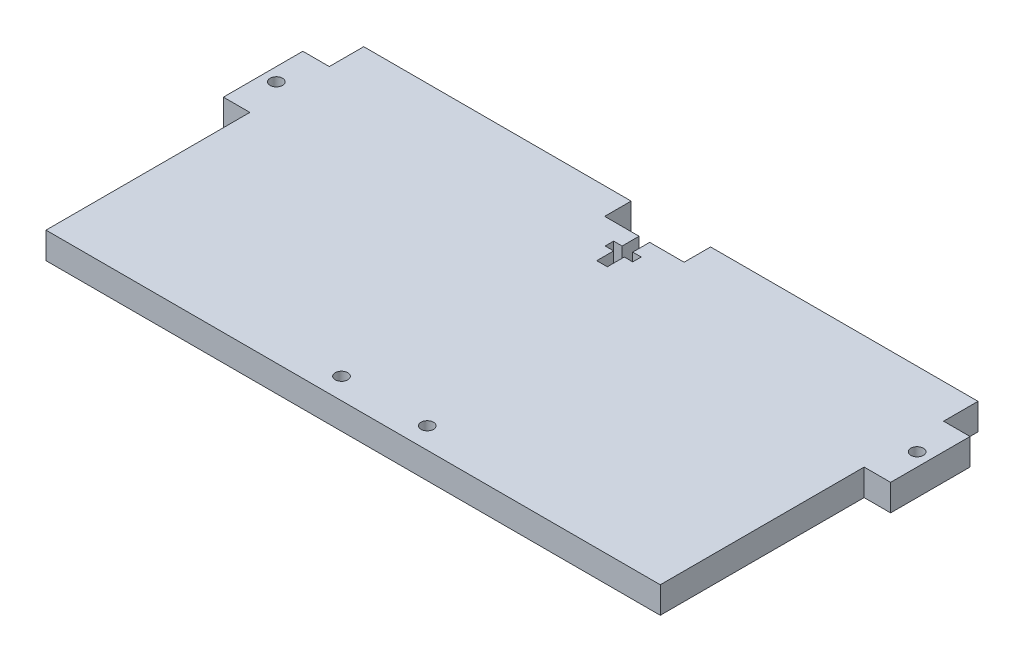
ISO-10303-21;
HEADER;
FILE_DESCRIPTION(('STEP AP214'),'2;1');
FILE_NAME('part.step','',(''),(''),'','','');
FILE_SCHEMA(('AUTOMOTIVE_DESIGN { 1 0 10303 214 1 1 1 1 }'));
ENDSEC;
DATA;
#1=APPLICATION_CONTEXT('core data for automotive mechanical design processes');
#2=APPLICATION_PROTOCOL_DEFINITION('international standard','automotive_design',2000,#1);
#3=PRODUCT_CONTEXT('',#1,'mechanical');
#4=PRODUCT('Part','Part','',(#3));
#5=PRODUCT_RELATED_PRODUCT_CATEGORY('part','',(#4));
#6=PRODUCT_DEFINITION_FORMATION('','',#4);
#7=PRODUCT_DEFINITION_CONTEXT('part definition',#1,'design');
#8=PRODUCT_DEFINITION('design','',#6,#7);
#9=PRODUCT_DEFINITION_SHAPE('','',#8);
#10=(LENGTH_UNIT() NAMED_UNIT(*) SI_UNIT(.MILLI.,.METRE.));
#11=(NAMED_UNIT(*) PLANE_ANGLE_UNIT() SI_UNIT($,.RADIAN.));
#12=(NAMED_UNIT(*) SI_UNIT($,.STERADIAN.) SOLID_ANGLE_UNIT());
#13=UNCERTAINTY_MEASURE_WITH_UNIT(LENGTH_MEASURE(1.E-05),#10,'distance_accuracy_value','');
#14=(GEOMETRIC_REPRESENTATION_CONTEXT(3) GLOBAL_UNCERTAINTY_ASSIGNED_CONTEXT((#13)) GLOBAL_UNIT_ASSIGNED_CONTEXT((#10,
#11,#12)) REPRESENTATION_CONTEXT('',''));
#15=CARTESIAN_POINT('',(0.,0.,0.));
#16=DIRECTION('',(0.,0.,1.));
#17=DIRECTION('',(1.,0.,0.));
#18=AXIS2_PLACEMENT_3D('',#15,#16,#17);
#19=CARTESIAN_POINT('',(-9.52499999999999,6.35,-34.925));
#20=DIRECTION('',(0.,0.,1.));
#21=DIRECTION('',(1.,0.,0.));
#22=AXIS2_PLACEMENT_3D('',#19,#20,#21);
#23=PLANE('',#22);
#24=DIRECTION('',(-1.,0.,0.));
#25=VECTOR('',#24,1.);
#26=CARTESIAN_POINT('',(-9.52499999999999,6.35,-34.925));
#27=LINE('',#26,#25);
#28=CARTESIAN_POINT('',(-1.27,6.35,-34.925));
#29=VERTEX_POINT('',#28);
#30=CARTESIAN_POINT('',(-9.52499999999999,6.35,-34.925));
#31=VERTEX_POINT('',#30);
#32=EDGE_CURVE('E454',#29,#31,#27,.T.);
#33=ORIENTED_EDGE('',*,*,#32,.F.);
#34=DIRECTION('',(0.,1.,0.));
#35=VECTOR('',#34,1.);
#36=CARTESIAN_POINT('',(-1.27,0.,-34.925));
#37=LINE('',#36,#35);
#38=CARTESIAN_POINT('',(-1.27,0.,-34.925));
#39=VERTEX_POINT('',#38);
#40=EDGE_CURVE('E328',#39,#29,#37,.T.);
#41=ORIENTED_EDGE('',*,*,#40,.F.);
#42=DIRECTION('',(-1.,0.,0.));
#43=VECTOR('',#42,1.);
#44=CARTESIAN_POINT('',(-9.52499999999999,0.,-34.925));
#45=LINE('',#44,#43);
#46=CARTESIAN_POINT('',(-9.52499999999999,0.,-34.925));
#47=VERTEX_POINT('',#46);
#48=EDGE_CURVE('E200',#39,#47,#45,.T.);
#49=ORIENTED_EDGE('',*,*,#48,.T.);
#50=DIRECTION('',(0.,-1.,0.));
#51=VECTOR('',#50,1.);
#52=CARTESIAN_POINT('',(-9.52499999999999,6.35,-34.925));
#53=LINE('',#52,#51);
#54=EDGE_CURVE('E256',#31,#47,#53,.T.);
#55=ORIENTED_EDGE('',*,*,#54,.F.);
#56=EDGE_LOOP('',(#33,#41,#49,#55));
#57=FACE_BOUND('',#56,.T.);
#58=ADVANCED_FACE('F32',(#57),#23,.F.);
#59=CARTESIAN_POINT('',(0.,6.35,0.));
#60=DIRECTION('',(0.,-1.,0.));
#61=DIRECTION('',(0.,0.,-1.));
#62=AXIS2_PLACEMENT_3D('',#59,#60,#61);
#63=PLANE('',#62);
#64=CARTESIAN_POINT('',(-7.87399999999999,6.35,29.845));
#65=DIRECTION('',(0.,1.,0.));
#66=DIRECTION('',(0.,0.,1.));
#67=AXIS2_PLACEMENT_3D('',#64,#65,#66);
#68=CIRCLE('',#67,1.5);
#69=CARTESIAN_POINT('',(-7.87399999999999,6.35,31.345));
#70=VERTEX_POINT('',#69);
#71=EDGE_CURVE('E429',#70,#70,#68,.T.);
#72=ORIENTED_EDGE('',*,*,#71,.F.);
#73=EDGE_LOOP('',(#72));
#74=FACE_BOUND('',#73,.T.);
#75=CARTESIAN_POINT('',(12.7,6.35,29.845));
#76=DIRECTION('',(0.,1.,0.));
#77=DIRECTION('',(0.,0.,1.));
#78=AXIS2_PLACEMENT_3D('',#75,#76,#77);
#79=CIRCLE('',#78,1.5);
#80=CARTESIAN_POINT('',(12.7,6.35,31.345));
#81=VERTEX_POINT('',#80);
#82=EDGE_CURVE('E432',#81,#81,#79,.T.);
#83=ORIENTED_EDGE('',*,*,#82,.F.);
#84=EDGE_LOOP('',(#83));
#85=FACE_BOUND('',#84,.T.);
#86=CARTESIAN_POINT('',(-76.835,6.35,-23.495));
#87=DIRECTION('',(0.,1.,0.));
#88=DIRECTION('',(0.,0.,1.));
#89=AXIS2_PLACEMENT_3D('',#86,#87,#88);
#90=CIRCLE('',#89,1.5);
#91=CARTESIAN_POINT('',(-76.835,6.35,-21.995));
#92=VERTEX_POINT('',#91);
#93=EDGE_CURVE('E198',#92,#92,#90,.T.);
#94=ORIENTED_EDGE('',*,*,#93,.F.);
#95=EDGE_LOOP('',(#94));
#96=FACE_BOUND('',#95,.T.);
#97=DIRECTION('',(-1.,0.,0.));
#98=VECTOR('',#97,1.);
#99=CARTESIAN_POINT('',(-1.27,6.35,-30.861));
#100=LINE('',#99,#98);
#101=CARTESIAN_POINT('',(-1.27,6.35,-30.861));
#102=VERTEX_POINT('',#101);
#103=CARTESIAN_POINT('',(-3.30199999999999,6.35,-30.861));
#104=VERTEX_POINT('',#103);
#105=EDGE_CURVE('E385',#102,#104,#100,.T.);
#106=ORIENTED_EDGE('',*,*,#105,.F.);
#107=DIRECTION('',(0.,0.,1.));
#108=VECTOR('',#107,1.);
#109=CARTESIAN_POINT('',(-1.27,6.35,-34.925));
#110=LINE('',#109,#108);
#111=EDGE_CURVE('E383',#29,#102,#110,.T.);
#112=ORIENTED_EDGE('',*,*,#111,.F.);
#113=ORIENTED_EDGE('',*,*,#32,.T.);
#114=DIRECTION('',(0.,0.,-1.));
#115=VECTOR('',#114,1.);
#116=CARTESIAN_POINT('',(-9.52499999999999,6.35,-34.925));
#117=LINE('',#116,#115);
#118=CARTESIAN_POINT('',(-9.52499999999999,6.35,-41.275));
#119=VERTEX_POINT('',#118);
#120=EDGE_CURVE('E457',#31,#119,#117,.T.);
#121=ORIENTED_EDGE('',*,*,#120,.T.);
#122=DIRECTION('',(-1.,0.,0.));
#123=VECTOR('',#122,1.);
#124=CARTESIAN_POINT('',(-9.52499999999999,6.35,-41.275));
#125=LINE('',#124,#123);
#126=CARTESIAN_POINT('',(-73.66,6.35,-41.275));
#127=VERTEX_POINT('',#126);
#128=EDGE_CURVE('E459',#119,#127,#125,.T.);
#129=ORIENTED_EDGE('',*,*,#128,.T.);
#130=DIRECTION('',(0.,0.,1.));
#131=VECTOR('',#130,1.);
#132=CARTESIAN_POINT('',(-73.66,6.35,-34.925));
#133=LINE('',#132,#131);
#134=CARTESIAN_POINT('',(-73.66,6.35,-33.02));
#135=VERTEX_POINT('',#134);
#136=EDGE_CURVE('E461',#127,#135,#133,.T.);
#137=ORIENTED_EDGE('',*,*,#136,.T.);
#138=DIRECTION('',(-1.,0.,0.));
#139=VECTOR('',#138,1.);
#140=CARTESIAN_POINT('',(-80.01,6.35,-33.02));
#141=LINE('',#140,#139);
#142=CARTESIAN_POINT('',(-80.01,6.35,-33.02));
#143=VERTEX_POINT('',#142);
#144=EDGE_CURVE('E463',#135,#143,#141,.T.);
#145=ORIENTED_EDGE('',*,*,#144,.T.);
#146=DIRECTION('',(0.,0.,1.));
#147=VECTOR('',#146,1.);
#148=CARTESIAN_POINT('',(-80.01,6.35,-13.97));
#149=LINE('',#148,#147);
#150=CARTESIAN_POINT('',(-80.01,6.35,-13.97));
#151=VERTEX_POINT('',#150);
#152=EDGE_CURVE('E465',#143,#151,#149,.T.);
#153=ORIENTED_EDGE('',*,*,#152,.T.);
#154=DIRECTION('',(1.,0.,0.));
#155=VECTOR('',#154,1.);
#156=CARTESIAN_POINT('',(-80.01,6.35,-13.97));
#157=LINE('',#156,#155);
#158=CARTESIAN_POINT('',(-73.66,6.35,-13.97));
#159=VERTEX_POINT('',#158);
#160=EDGE_CURVE('E467',#151,#159,#157,.T.);
#161=ORIENTED_EDGE('',*,*,#160,.T.);
#162=DIRECTION('',(0.,0.,1.));
#163=VECTOR('',#162,1.);
#164=CARTESIAN_POINT('',(-73.66,6.35,34.925));
#165=LINE('',#164,#163);
#166=CARTESIAN_POINT('',(-73.66,6.35,34.925));
#167=VERTEX_POINT('',#166);
#168=EDGE_CURVE('E469',#159,#167,#165,.T.);
#169=ORIENTED_EDGE('',*,*,#168,.T.);
#170=DIRECTION('',(1.,0.,0.));
#171=VECTOR('',#170,1.);
#172=CARTESIAN_POINT('',(-73.66,6.35,34.925));
#173=LINE('',#172,#171);
#174=CARTESIAN_POINT('',(73.66,6.35,34.925));
#175=VERTEX_POINT('',#174);
#176=EDGE_CURVE('E471',#167,#175,#173,.T.);
#177=ORIENTED_EDGE('',*,*,#176,.T.);
#178=DIRECTION('',(0.,0.,-1.));
#179=VECTOR('',#178,1.);
#180=CARTESIAN_POINT('',(73.66,6.35,34.925));
#181=LINE('',#180,#179);
#182=CARTESIAN_POINT('',(73.66,6.35,-13.97));
#183=VERTEX_POINT('',#182);
#184=EDGE_CURVE('E172',#175,#183,#181,.T.);
#185=ORIENTED_EDGE('',*,*,#184,.T.);
#186=DIRECTION('',(1.,0.,0.));
#187=VECTOR('',#186,1.);
#188=CARTESIAN_POINT('',(80.01,6.35,-13.97));
#189=LINE('',#188,#187);
#190=CARTESIAN_POINT('',(80.01,6.35,-13.97));
#191=VERTEX_POINT('',#190);
#192=EDGE_CURVE('E163',#183,#191,#189,.T.);
#193=ORIENTED_EDGE('',*,*,#192,.T.);
#194=DIRECTION('',(0.,0.,-1.));
#195=VECTOR('',#194,1.);
#196=CARTESIAN_POINT('',(80.01,6.35,-13.97));
#197=LINE('',#196,#195);
#198=CARTESIAN_POINT('',(80.01,6.35,-33.02));
#199=VERTEX_POINT('',#198);
#200=EDGE_CURVE('E169',#191,#199,#197,.T.);
#201=ORIENTED_EDGE('',*,*,#200,.T.);
#202=DIRECTION('',(-1.,0.,0.));
#203=VECTOR('',#202,1.);
#204=CARTESIAN_POINT('',(80.01,6.35,-33.02));
#205=LINE('',#204,#203);
#206=CARTESIAN_POINT('',(73.66,6.35,-33.02));
#207=VERTEX_POINT('',#206);
#208=EDGE_CURVE('E189',#199,#207,#205,.T.);
#209=ORIENTED_EDGE('',*,*,#208,.T.);
#210=DIRECTION('',(0.,0.,-1.));
#211=VECTOR('',#210,1.);
#212=CARTESIAN_POINT('',(73.66,6.35,-41.275));
#213=LINE('',#212,#211);
#214=CARTESIAN_POINT('',(73.66,6.35,-41.275));
#215=VERTEX_POINT('',#214);
#216=EDGE_CURVE('E56',#207,#215,#213,.T.);
#217=ORIENTED_EDGE('',*,*,#216,.T.);
#218=DIRECTION('',(-1.,0.,0.));
#219=VECTOR('',#218,1.);
#220=CARTESIAN_POINT('',(9.52500000000001,6.35,-41.275));
#221=LINE('',#220,#219);
#222=CARTESIAN_POINT('',(9.52500000000001,6.35,-41.275));
#223=VERTEX_POINT('',#222);
#224=EDGE_CURVE('E122',#215,#223,#221,.T.);
#225=ORIENTED_EDGE('',*,*,#224,.T.);
#226=DIRECTION('',(0.,0.,1.));
#227=VECTOR('',#226,1.);
#228=CARTESIAN_POINT('',(9.52500000000001,6.35,-41.275));
#229=LINE('',#228,#227);
#230=CARTESIAN_POINT('',(9.52500000000001,6.35,-34.925));
#231=VERTEX_POINT('',#230);
#232=EDGE_CURVE('E267',#223,#231,#229,.T.);
#233=ORIENTED_EDGE('',*,*,#232,.T.);
#234=CARTESIAN_POINT('',(1.27,6.35,-34.925));
#235=VERTEX_POINT('',#234);
#236=EDGE_CURVE('E455',#231,#235,#27,.T.);
#237=ORIENTED_EDGE('',*,*,#236,.T.);
#238=DIRECTION('',(0.,0.,-1.));
#239=VECTOR('',#238,1.);
#240=CARTESIAN_POINT('',(1.27,6.35,-34.925));
#241=LINE('',#240,#239);
#242=CARTESIAN_POINT('',(1.27,6.35,-30.861));
#243=VERTEX_POINT('',#242);
#244=EDGE_CURVE('E47',#243,#235,#241,.T.);
#245=ORIENTED_EDGE('',*,*,#244,.F.);
#246=DIRECTION('',(-1.,0.,0.));
#247=VECTOR('',#246,1.);
#248=CARTESIAN_POINT('',(1.27,6.35,-30.861));
#249=LINE('',#248,#247);
#250=CARTESIAN_POINT('',(3.30199999999999,6.35,-30.861));
#251=VERTEX_POINT('',#250);
#252=EDGE_CURVE('E407',#251,#243,#249,.T.);
#253=ORIENTED_EDGE('',*,*,#252,.F.);
#254=DIRECTION('',(0.,0.,-1.));
#255=VECTOR('',#254,1.);
#256=CARTESIAN_POINT('',(3.30199999999999,6.35,-30.861));
#257=LINE('',#256,#255);
#258=CARTESIAN_POINT('',(3.30199999999999,6.35,-28.829));
#259=VERTEX_POINT('',#258);
#260=EDGE_CURVE('E366',#259,#251,#257,.T.);
#261=ORIENTED_EDGE('',*,*,#260,.F.);
#262=DIRECTION('',(1.,0.,0.));
#263=VECTOR('',#262,1.);
#264=CARTESIAN_POINT('',(1.27,6.35,-28.829));
#265=LINE('',#264,#263);
#266=CARTESIAN_POINT('',(1.27,6.35,-28.829));
#267=VERTEX_POINT('',#266);
#268=EDGE_CURVE('E403',#267,#259,#265,.T.);
#269=ORIENTED_EDGE('',*,*,#268,.F.);
#270=DIRECTION('',(0.,0.,-1.));
#271=VECTOR('',#270,1.);
#272=CARTESIAN_POINT('',(1.27,6.35,-28.829));
#273=LINE('',#272,#271);
#274=CARTESIAN_POINT('',(1.27,6.35,-24.765));
#275=VERTEX_POINT('',#274);
#276=EDGE_CURVE('E400',#275,#267,#273,.T.);
#277=ORIENTED_EDGE('',*,*,#276,.F.);
#278=DIRECTION('',(1.,0.,0.));
#279=VECTOR('',#278,1.);
#280=CARTESIAN_POINT('',(-1.27,6.35,-24.765));
#281=LINE('',#280,#279);
#282=CARTESIAN_POINT('',(-1.27,6.35,-24.765));
#283=VERTEX_POINT('',#282);
#284=EDGE_CURVE('E397',#283,#275,#281,.T.);
#285=ORIENTED_EDGE('',*,*,#284,.F.);
#286=DIRECTION('',(0.,0.,1.));
#287=VECTOR('',#286,1.);
#288=CARTESIAN_POINT('',(-1.27,6.35,-28.829));
#289=LINE('',#288,#287);
#290=CARTESIAN_POINT('',(-1.27,6.35,-28.829));
#291=VERTEX_POINT('',#290);
#292=EDGE_CURVE('E394',#291,#283,#289,.T.);
#293=ORIENTED_EDGE('',*,*,#292,.F.);
#294=DIRECTION('',(1.,0.,0.));
#295=VECTOR('',#294,1.);
#296=CARTESIAN_POINT('',(-1.27,6.35,-28.829));
#297=LINE('',#296,#295);
#298=CARTESIAN_POINT('',(-3.30199999999999,6.35,-28.829));
#299=VERTEX_POINT('',#298);
#300=EDGE_CURVE('E391',#299,#291,#297,.T.);
#301=ORIENTED_EDGE('',*,*,#300,.F.);
#302=DIRECTION('',(0.,0.,1.));
#303=VECTOR('',#302,1.);
#304=CARTESIAN_POINT('',(-3.30199999999999,6.35,-30.861));
#305=LINE('',#304,#303);
#306=EDGE_CURVE('E388',#104,#299,#305,.T.);
#307=ORIENTED_EDGE('',*,*,#306,.F.);
#308=EDGE_LOOP('',(#106,#112,#113,#121,#129,#137,#145,#153,#161,#169,#177,#185,#193,#201,#209,
#217,#225,#233,#237,#245,#253,#261,#269,#277,#285,#293,#301,#307));
#309=FACE_BOUND('',#308,.T.);
#310=CARTESIAN_POINT('',(76.835,6.35,-23.495));
#311=DIRECTION('',(0.,1.,0.));
#312=DIRECTION('',(0.,0.,-1.));
#313=AXIS2_PLACEMENT_3D('',#310,#311,#312);
#314=CIRCLE('',#313,1.5);
#315=CARTESIAN_POINT('',(76.835,6.35,-24.995));
#316=VERTEX_POINT('',#315);
#317=EDGE_CURVE('E441',#316,#316,#314,.T.);
#318=ORIENTED_EDGE('',*,*,#317,.F.);
#319=EDGE_LOOP('',(#318));
#320=FACE_BOUND('',#319,.T.);
#321=ADVANCED_FACE('F166',(#74,#85,#96,#309,#320),#63,.F.);
#322=CARTESIAN_POINT('',(0.,0.,0.));
#323=DIRECTION('',(0.,-1.,0.));
#324=DIRECTION('',(0.,0.,-1.));
#325=AXIS2_PLACEMENT_3D('',#322,#323,#324);
#326=PLANE('',#325);
#327=DIRECTION('',(0.,0.,1.));
#328=VECTOR('',#327,1.);
#329=CARTESIAN_POINT('',(-1.27,0.,-34.925));
#330=LINE('',#329,#328);
#331=CARTESIAN_POINT('',(-1.27,0.,-30.861));
#332=VERTEX_POINT('',#331);
#333=EDGE_CURVE('E410',#39,#332,#330,.T.);
#334=ORIENTED_EDGE('',*,*,#333,.T.);
#335=DIRECTION('',(-1.,0.,0.));
#336=VECTOR('',#335,1.);
#337=CARTESIAN_POINT('',(-1.27,0.,-30.861));
#338=LINE('',#337,#336);
#339=CARTESIAN_POINT('',(-3.30199999999999,0.,-30.861));
#340=VERTEX_POINT('',#339);
#341=EDGE_CURVE('E839',#332,#340,#338,.T.);
#342=ORIENTED_EDGE('',*,*,#341,.T.);
#343=DIRECTION('',(0.,0.,1.));
#344=VECTOR('',#343,1.);
#345=CARTESIAN_POINT('',(-3.30199999999999,0.,-30.861));
#346=LINE('',#345,#344);
#347=CARTESIAN_POINT('',(-3.30199999999999,0.,-28.829));
#348=VERTEX_POINT('',#347);
#349=EDGE_CURVE('E817',#340,#348,#346,.T.);
#350=ORIENTED_EDGE('',*,*,#349,.T.);
#351=DIRECTION('',(1.,0.,0.));
#352=VECTOR('',#351,1.);
#353=CARTESIAN_POINT('',(-1.27,0.,-28.829));
#354=LINE('',#353,#352);
#355=CARTESIAN_POINT('',(-1.27,0.,-28.829));
#356=VERTEX_POINT('',#355);
#357=EDGE_CURVE('E814',#348,#356,#354,.T.);
#358=ORIENTED_EDGE('',*,*,#357,.T.);
#359=DIRECTION('',(0.,0.,1.));
#360=VECTOR('',#359,1.);
#361=CARTESIAN_POINT('',(-1.27,0.,-28.829));
#362=LINE('',#361,#360);
#363=CARTESIAN_POINT('',(-1.27,0.,-24.765));
#364=VERTEX_POINT('',#363);
#365=EDGE_CURVE('E845',#356,#364,#362,.T.);
#366=ORIENTED_EDGE('',*,*,#365,.T.);
#367=DIRECTION('',(1.,0.,0.));
#368=VECTOR('',#367,1.);
#369=CARTESIAN_POINT('',(-1.27,0.,-24.765));
#370=LINE('',#369,#368);
#371=CARTESIAN_POINT('',(1.27,0.,-24.765));
#372=VERTEX_POINT('',#371);
#373=EDGE_CURVE('E807',#364,#372,#370,.T.);
#374=ORIENTED_EDGE('',*,*,#373,.T.);
#375=DIRECTION('',(0.,0.,-1.));
#376=VECTOR('',#375,1.);
#377=CARTESIAN_POINT('',(1.27,0.,-28.829));
#378=LINE('',#377,#376);
#379=CARTESIAN_POINT('',(1.27,0.,-28.829));
#380=VERTEX_POINT('',#379);
#381=EDGE_CURVE('E378',#372,#380,#378,.T.);
#382=ORIENTED_EDGE('',*,*,#381,.T.);
#383=DIRECTION('',(1.,0.,0.));
#384=VECTOR('',#383,1.);
#385=CARTESIAN_POINT('',(1.27,0.,-28.829));
#386=LINE('',#385,#384);
#387=CARTESIAN_POINT('',(3.30199999999999,0.,-28.829));
#388=VERTEX_POINT('',#387);
#389=EDGE_CURVE('E376',#380,#388,#386,.T.);
#390=ORIENTED_EDGE('',*,*,#389,.T.);
#391=DIRECTION('',(0.,0.,-1.));
#392=VECTOR('',#391,1.);
#393=CARTESIAN_POINT('',(3.30199999999999,0.,-30.861));
#394=LINE('',#393,#392);
#395=CARTESIAN_POINT('',(3.30199999999999,0.,-30.861));
#396=VERTEX_POINT('',#395);
#397=EDGE_CURVE('E363',#388,#396,#394,.T.);
#398=ORIENTED_EDGE('',*,*,#397,.T.);
#399=DIRECTION('',(-1.,0.,0.));
#400=VECTOR('',#399,1.);
#401=CARTESIAN_POINT('',(1.27,0.,-30.861));
#402=LINE('',#401,#400);
#403=CARTESIAN_POINT('',(1.27,0.,-30.861));
#404=VERTEX_POINT('',#403);
#405=EDGE_CURVE('E371',#396,#404,#402,.T.);
#406=ORIENTED_EDGE('',*,*,#405,.T.);
#407=DIRECTION('',(0.,0.,-1.));
#408=VECTOR('',#407,1.);
#409=CARTESIAN_POINT('',(1.27,0.,-34.925));
#410=LINE('',#409,#408);
#411=CARTESIAN_POINT('',(1.27,0.,-34.925));
#412=VERTEX_POINT('',#411);
#413=EDGE_CURVE('E279',#404,#412,#410,.T.);
#414=ORIENTED_EDGE('',*,*,#413,.T.);
#415=CARTESIAN_POINT('',(9.52500000000001,0.,-34.925));
#416=VERTEX_POINT('',#415);
#417=EDGE_CURVE('E201',#416,#412,#45,.T.);
#418=ORIENTED_EDGE('',*,*,#417,.F.);
#419=DIRECTION('',(0.,0.,1.));
#420=VECTOR('',#419,1.);
#421=CARTESIAN_POINT('',(9.52500000000001,0.,-41.275));
#422=LINE('',#421,#420);
#423=CARTESIAN_POINT('',(9.52500000000001,0.,-41.275));
#424=VERTEX_POINT('',#423);
#425=EDGE_CURVE('E197',#424,#416,#422,.T.);
#426=ORIENTED_EDGE('',*,*,#425,.F.);
#427=DIRECTION('',(-1.,0.,0.));
#428=VECTOR('',#427,1.);
#429=CARTESIAN_POINT('',(9.52500000000001,0.,-41.275));
#430=LINE('',#429,#428);
#431=CARTESIAN_POINT('',(73.66,0.,-41.275));
#432=VERTEX_POINT('',#431);
#433=EDGE_CURVE('E195',#432,#424,#430,.T.);
#434=ORIENTED_EDGE('',*,*,#433,.F.);
#435=DIRECTION('',(0.,0.,-1.));
#436=VECTOR('',#435,1.);
#437=CARTESIAN_POINT('',(73.66,0.,-33.02));
#438=LINE('',#437,#436);
#439=CARTESIAN_POINT('',(73.66,0.,-33.02));
#440=VERTEX_POINT('',#439);
#441=EDGE_CURVE('E227',#440,#432,#438,.T.);
#442=ORIENTED_EDGE('',*,*,#441,.F.);
#443=DIRECTION('',(-1.,0.,0.));
#444=VECTOR('',#443,1.);
#445=CARTESIAN_POINT('',(80.01,0.,-33.02));
#446=LINE('',#445,#444);
#447=CARTESIAN_POINT('',(80.01,0.,-33.02));
#448=VERTEX_POINT('',#447);
#449=EDGE_CURVE('E115',#448,#440,#446,.T.);
#450=ORIENTED_EDGE('',*,*,#449,.F.);
#451=DIRECTION('',(0.,0.,-1.));
#452=VECTOR('',#451,1.);
#453=CARTESIAN_POINT('',(80.01,0.,-13.97));
#454=LINE('',#453,#452);
#455=CARTESIAN_POINT('',(80.01,0.,-13.97));
#456=VERTEX_POINT('',#455);
#457=EDGE_CURVE('E224',#456,#448,#454,.T.);
#458=ORIENTED_EDGE('',*,*,#457,.F.);
#459=DIRECTION('',(1.,0.,0.));
#460=VECTOR('',#459,1.);
#461=CARTESIAN_POINT('',(80.01,0.,-13.97));
#462=LINE('',#461,#460);
#463=CARTESIAN_POINT('',(73.66,0.,-13.97));
#464=VERTEX_POINT('',#463);
#465=EDGE_CURVE('E181',#464,#456,#462,.T.);
#466=ORIENTED_EDGE('',*,*,#465,.F.);
#467=DIRECTION('',(0.,0.,-1.));
#468=VECTOR('',#467,1.);
#469=CARTESIAN_POINT('',(73.66,0.,34.925));
#470=LINE('',#469,#468);
#471=CARTESIAN_POINT('',(73.66,0.,34.925));
#472=VERTEX_POINT('',#471);
#473=EDGE_CURVE('E221',#472,#464,#470,.T.);
#474=ORIENTED_EDGE('',*,*,#473,.F.);
#475=DIRECTION('',(1.,0.,0.));
#476=VECTOR('',#475,1.);
#477=CARTESIAN_POINT('',(-73.66,0.,34.925));
#478=LINE('',#477,#476);
#479=CARTESIAN_POINT('',(-73.66,0.,34.925));
#480=VERTEX_POINT('',#479);
#481=EDGE_CURVE('E219',#480,#472,#478,.T.);
#482=ORIENTED_EDGE('',*,*,#481,.F.);
#483=DIRECTION('',(0.,0.,1.));
#484=VECTOR('',#483,1.);
#485=CARTESIAN_POINT('',(-73.66,0.,34.925));
#486=LINE('',#485,#484);
#487=CARTESIAN_POINT('',(-73.66,0.,-13.97));
#488=VERTEX_POINT('',#487);
#489=EDGE_CURVE('E217',#488,#480,#486,.T.);
#490=ORIENTED_EDGE('',*,*,#489,.F.);
#491=DIRECTION('',(1.,0.,0.));
#492=VECTOR('',#491,1.);
#493=CARTESIAN_POINT('',(-80.01,0.,-13.97));
#494=LINE('',#493,#492);
#495=CARTESIAN_POINT('',(-80.01,0.,-13.97));
#496=VERTEX_POINT('',#495);
#497=EDGE_CURVE('E215',#496,#488,#494,.T.);
#498=ORIENTED_EDGE('',*,*,#497,.F.);
#499=DIRECTION('',(0.,0.,1.));
#500=VECTOR('',#499,1.);
#501=CARTESIAN_POINT('',(-80.01,0.,-13.97));
#502=LINE('',#501,#500);
#503=CARTESIAN_POINT('',(-80.01,0.,-33.02));
#504=VERTEX_POINT('',#503);
#505=EDGE_CURVE('E213',#504,#496,#502,.T.);
#506=ORIENTED_EDGE('',*,*,#505,.F.);
#507=DIRECTION('',(-1.,0.,0.));
#508=VECTOR('',#507,1.);
#509=CARTESIAN_POINT('',(-80.01,0.,-33.02));
#510=LINE('',#509,#508);
#511=CARTESIAN_POINT('',(-73.66,0.,-33.02));
#512=VERTEX_POINT('',#511);
#513=EDGE_CURVE('E211',#512,#504,#510,.T.);
#514=ORIENTED_EDGE('',*,*,#513,.F.);
#515=DIRECTION('',(0.,0.,1.));
#516=VECTOR('',#515,1.);
#517=CARTESIAN_POINT('',(-73.66,0.,-33.02));
#518=LINE('',#517,#516);
#519=CARTESIAN_POINT('',(-73.66,0.,-41.275));
#520=VERTEX_POINT('',#519);
#521=EDGE_CURVE('E209',#520,#512,#518,.T.);
#522=ORIENTED_EDGE('',*,*,#521,.F.);
#523=DIRECTION('',(-1.,0.,0.));
#524=VECTOR('',#523,1.);
#525=CARTESIAN_POINT('',(-9.52499999999999,0.,-41.275));
#526=LINE('',#525,#524);
#527=CARTESIAN_POINT('',(-9.52499999999999,0.,-41.275));
#528=VERTEX_POINT('',#527);
#529=EDGE_CURVE('E206',#528,#520,#526,.T.);
#530=ORIENTED_EDGE('',*,*,#529,.F.);
#531=DIRECTION('',(0.,0.,-1.));
#532=VECTOR('',#531,1.);
#533=CARTESIAN_POINT('',(-9.52499999999999,0.,-34.925));
#534=LINE('',#533,#532);
#535=EDGE_CURVE('E204',#47,#528,#534,.T.);
#536=ORIENTED_EDGE('',*,*,#535,.F.);
#537=ORIENTED_EDGE('',*,*,#48,.F.);
#538=EDGE_LOOP('',(#334,#342,#350,#358,#366,#374,#382,#390,#398,#406,#414,#418,#426,#434,#442,
#450,#458,#466,#474,#482,#490,#498,#506,#514,#522,#530,#536,#537));
#539=FACE_BOUND('',#538,.T.);
#540=CARTESIAN_POINT('',(-7.87399999999999,0.,29.845));
#541=DIRECTION('',(0.,1.,0.));
#542=DIRECTION('',(0.,0.,1.));
#543=AXIS2_PLACEMENT_3D('',#540,#541,#542);
#544=CIRCLE('',#543,1.5);
#545=CARTESIAN_POINT('',(-7.87399999999999,0.,31.345));
#546=VERTEX_POINT('',#545);
#547=EDGE_CURVE('E412',#546,#546,#544,.T.);
#548=ORIENTED_EDGE('',*,*,#547,.T.);
#549=EDGE_LOOP('',(#548));
#550=FACE_BOUND('',#549,.T.);
#551=CARTESIAN_POINT('',(12.7,0.,29.845));
#552=DIRECTION('',(0.,1.,0.));
#553=DIRECTION('',(0.,0.,1.));
#554=AXIS2_PLACEMENT_3D('',#551,#552,#553);
#555=CIRCLE('',#554,1.5);
#556=CARTESIAN_POINT('',(12.7,0.,31.345));
#557=VERTEX_POINT('',#556);
#558=EDGE_CURVE('E435',#557,#557,#555,.T.);
#559=ORIENTED_EDGE('',*,*,#558,.T.);
#560=EDGE_LOOP('',(#559));
#561=FACE_BOUND('',#560,.T.);
#562=CARTESIAN_POINT('',(-76.835,0.,-23.495));
#563=DIRECTION('',(0.,1.,0.));
#564=DIRECTION('',(0.,0.,1.));
#565=AXIS2_PLACEMENT_3D('',#562,#563,#564);
#566=CIRCLE('',#565,1.5);
#567=CARTESIAN_POINT('',(-76.835,0.,-21.995));
#568=VERTEX_POINT('',#567);
#569=EDGE_CURVE('E444',#568,#568,#566,.T.);
#570=ORIENTED_EDGE('',*,*,#569,.T.);
#571=EDGE_LOOP('',(#570));
#572=FACE_BOUND('',#571,.T.);
#573=CARTESIAN_POINT('',(76.835,0.,-23.495));
#574=DIRECTION('',(0.,1.,0.));
#575=DIRECTION('',(0.,0.,-1.));
#576=AXIS2_PLACEMENT_3D('',#573,#574,#575);
#577=CIRCLE('',#576,1.5);
#578=CARTESIAN_POINT('',(76.835,0.,-24.995));
#579=VERTEX_POINT('',#578);
#580=EDGE_CURVE('E438',#579,#579,#577,.T.);
#581=ORIENTED_EDGE('',*,*,#580,.T.);
#582=EDGE_LOOP('',(#581));
#583=FACE_BOUND('',#582,.T.);
#584=ADVANCED_FACE('F272',(#539,#550,#561,#572,#583),#326,.T.);
#585=CARTESIAN_POINT('',(9.52500000000001,6.35,-41.275));
#586=DIRECTION('',(0.,0.,1.));
#587=DIRECTION('',(1.,0.,0.));
#588=AXIS2_PLACEMENT_3D('',#585,#586,#587);
#589=PLANE('',#588);
#590=ORIENTED_EDGE('',*,*,#433,.T.);
#591=DIRECTION('',(0.,-1.,0.));
#592=VECTOR('',#591,1.);
#593=CARTESIAN_POINT('',(9.52500000000001,6.35,-41.275));
#594=LINE('',#593,#592);
#595=EDGE_CURVE('E40',#223,#424,#594,.T.);
#596=ORIENTED_EDGE('',*,*,#595,.F.);
#597=ORIENTED_EDGE('',*,*,#224,.F.);
#598=DIRECTION('',(0.,-1.,0.));
#599=VECTOR('',#598,1.);
#600=CARTESIAN_POINT('',(73.66,6.35,-41.275));
#601=LINE('',#600,#599);
#602=EDGE_CURVE('E11',#215,#432,#601,.T.);
#603=ORIENTED_EDGE('',*,*,#602,.T.);
#604=EDGE_LOOP('',(#590,#596,#597,#603));
#605=FACE_BOUND('',#604,.T.);
#606=ADVANCED_FACE('F34',(#605),#589,.F.);
#607=CARTESIAN_POINT('',(9.52500000000001,6.35,-41.275));
#608=DIRECTION('',(1.,0.,0.));
#609=DIRECTION('',(0.,0.,-1.));
#610=AXIS2_PLACEMENT_3D('',#607,#608,#609);
#611=PLANE('',#610);
#612=ORIENTED_EDGE('',*,*,#425,.T.);
#613=DIRECTION('',(0.,-1.,0.));
#614=VECTOR('',#613,1.);
#615=CARTESIAN_POINT('',(9.52500000000001,6.35,-34.925));
#616=LINE('',#615,#614);
#617=EDGE_CURVE('E259',#231,#416,#616,.T.);
#618=ORIENTED_EDGE('',*,*,#617,.F.);
#619=ORIENTED_EDGE('',*,*,#232,.F.);
#620=ORIENTED_EDGE('',*,*,#595,.T.);
#621=EDGE_LOOP('',(#612,#618,#619,#620));
#622=FACE_BOUND('',#621,.T.);
#623=ADVANCED_FACE('F265',(#622),#611,.F.);
#624=ORIENTED_EDGE('',*,*,#417,.T.);
#625=DIRECTION('',(0.,1.,0.));
#626=VECTOR('',#625,1.);
#627=CARTESIAN_POINT('',(1.27,0.,-34.925));
#628=LINE('',#627,#626);
#629=EDGE_CURVE('E283',#412,#235,#628,.T.);
#630=ORIENTED_EDGE('',*,*,#629,.T.);
#631=ORIENTED_EDGE('',*,*,#236,.F.);
#632=ORIENTED_EDGE('',*,*,#617,.T.);
#633=EDGE_LOOP('',(#624,#630,#631,#632));
#634=FACE_BOUND('',#633,.T.);
#635=ADVANCED_FACE('F281',(#634),#23,.F.);
#636=CARTESIAN_POINT('',(-9.52499999999999,6.35,-34.925));
#637=DIRECTION('',(-1.,0.,0.));
#638=DIRECTION('',(0.,0.,1.));
#639=AXIS2_PLACEMENT_3D('',#636,#637,#638);
#640=PLANE('',#639);
#641=ORIENTED_EDGE('',*,*,#535,.T.);
#642=DIRECTION('',(0.,-1.,0.));
#643=VECTOR('',#642,1.);
#644=CARTESIAN_POINT('',(-9.52499999999999,6.35,-41.275));
#645=LINE('',#644,#643);
#646=EDGE_CURVE('E253',#119,#528,#645,.T.);
#647=ORIENTED_EDGE('',*,*,#646,.F.);
#648=ORIENTED_EDGE('',*,*,#120,.F.);
#649=ORIENTED_EDGE('',*,*,#54,.T.);
#650=EDGE_LOOP('',(#641,#647,#648,#649));
#651=FACE_BOUND('',#650,.T.);
#652=ADVANCED_FACE('F501',(#651),#640,.F.);
#653=CARTESIAN_POINT('',(-9.52499999999999,6.35,-41.275));
#654=DIRECTION('',(0.,0.,1.));
#655=DIRECTION('',(1.,0.,0.));
#656=AXIS2_PLACEMENT_3D('',#653,#654,#655);
#657=PLANE('',#656);
#658=ORIENTED_EDGE('',*,*,#529,.T.);
#659=DIRECTION('',(0.,-1.,0.));
#660=VECTOR('',#659,1.);
#661=CARTESIAN_POINT('',(-73.66,6.35,-41.275));
#662=LINE('',#661,#660);
#663=EDGE_CURVE('E250',#127,#520,#662,.T.);
#664=ORIENTED_EDGE('',*,*,#663,.F.);
#665=ORIENTED_EDGE('',*,*,#128,.F.);
#666=ORIENTED_EDGE('',*,*,#646,.T.);
#667=EDGE_LOOP('',(#658,#664,#665,#666));
#668=FACE_BOUND('',#667,.T.);
#669=ADVANCED_FACE('F505',(#668),#657,.F.);
#670=CARTESIAN_POINT('',(-73.66,6.35,-33.02));
#671=DIRECTION('',(1.,0.,0.));
#672=DIRECTION('',(0.,0.,-1.));
#673=AXIS2_PLACEMENT_3D('',#670,#671,#672);
#674=PLANE('',#673);
#675=ORIENTED_EDGE('',*,*,#521,.T.);
#676=DIRECTION('',(0.,-1.,0.));
#677=VECTOR('',#676,1.);
#678=CARTESIAN_POINT('',(-73.66,6.35,-33.02));
#679=LINE('',#678,#677);
#680=EDGE_CURVE('E247',#135,#512,#679,.T.);
#681=ORIENTED_EDGE('',*,*,#680,.F.);
#682=ORIENTED_EDGE('',*,*,#136,.F.);
#683=ORIENTED_EDGE('',*,*,#663,.T.);
#684=EDGE_LOOP('',(#675,#681,#682,#683));
#685=FACE_BOUND('',#684,.T.);
#686=ADVANCED_FACE('F510',(#685),#674,.F.);
#687=CARTESIAN_POINT('',(-80.01,6.35,-33.02));
#688=DIRECTION('',(0.,0.,1.));
#689=DIRECTION('',(1.,0.,0.));
#690=AXIS2_PLACEMENT_3D('',#687,#688,#689);
#691=PLANE('',#690);
#692=ORIENTED_EDGE('',*,*,#513,.T.);
#693=DIRECTION('',(0.,-1.,0.));
#694=VECTOR('',#693,1.);
#695=CARTESIAN_POINT('',(-80.01,6.35,-33.02));
#696=LINE('',#695,#694);
#697=EDGE_CURVE('E244',#143,#504,#696,.T.);
#698=ORIENTED_EDGE('',*,*,#697,.F.);
#699=ORIENTED_EDGE('',*,*,#144,.F.);
#700=ORIENTED_EDGE('',*,*,#680,.T.);
#701=EDGE_LOOP('',(#692,#698,#699,#700));
#702=FACE_BOUND('',#701,.T.);
#703=ADVANCED_FACE('F516',(#702),#691,.F.);
#704=CARTESIAN_POINT('',(-80.01,6.35,-13.97));
#705=DIRECTION('',(1.,0.,0.));
#706=DIRECTION('',(0.,0.,-1.));
#707=AXIS2_PLACEMENT_3D('',#704,#705,#706);
#708=PLANE('',#707);
#709=ORIENTED_EDGE('',*,*,#505,.T.);
#710=DIRECTION('',(0.,-1.,0.));
#711=VECTOR('',#710,1.);
#712=CARTESIAN_POINT('',(-80.01,6.35,-13.97));
#713=LINE('',#712,#711);
#714=EDGE_CURVE('E241',#151,#496,#713,.T.);
#715=ORIENTED_EDGE('',*,*,#714,.F.);
#716=ORIENTED_EDGE('',*,*,#152,.F.);
#717=ORIENTED_EDGE('',*,*,#697,.T.);
#718=EDGE_LOOP('',(#709,#715,#716,#717));
#719=FACE_BOUND('',#718,.T.);
#720=ADVANCED_FACE('F520',(#719),#708,.F.);
#721=CARTESIAN_POINT('',(-80.01,6.35,-13.97));
#722=DIRECTION('',(0.,0.,-1.));
#723=DIRECTION('',(-1.,0.,0.));
#724=AXIS2_PLACEMENT_3D('',#721,#722,#723);
#725=PLANE('',#724);
#726=ORIENTED_EDGE('',*,*,#497,.T.);
#727=DIRECTION('',(0.,-1.,0.));
#728=VECTOR('',#727,1.);
#729=CARTESIAN_POINT('',(-73.66,6.35,-13.97));
#730=LINE('',#729,#728);
#731=EDGE_CURVE('E238',#159,#488,#730,.T.);
#732=ORIENTED_EDGE('',*,*,#731,.F.);
#733=ORIENTED_EDGE('',*,*,#160,.F.);
#734=ORIENTED_EDGE('',*,*,#714,.T.);
#735=EDGE_LOOP('',(#726,#732,#733,#734));
#736=FACE_BOUND('',#735,.T.);
#737=ADVANCED_FACE('F524',(#736),#725,.F.);
#738=CARTESIAN_POINT('',(-73.66,6.35,34.925));
#739=DIRECTION('',(1.,0.,0.));
#740=DIRECTION('',(0.,0.,-1.));
#741=AXIS2_PLACEMENT_3D('',#738,#739,#740);
#742=PLANE('',#741);
#743=ORIENTED_EDGE('',*,*,#489,.T.);
#744=DIRECTION('',(0.,-1.,0.));
#745=VECTOR('',#744,1.);
#746=CARTESIAN_POINT('',(-73.66,6.35,34.925));
#747=LINE('',#746,#745);
#748=EDGE_CURVE('E235',#167,#480,#747,.T.);
#749=ORIENTED_EDGE('',*,*,#748,.F.);
#750=ORIENTED_EDGE('',*,*,#168,.F.);
#751=ORIENTED_EDGE('',*,*,#731,.T.);
#752=EDGE_LOOP('',(#743,#749,#750,#751));
#753=FACE_BOUND('',#752,.T.);
#754=ADVANCED_FACE('F528',(#753),#742,.F.);
#755=CARTESIAN_POINT('',(-73.66,6.35,34.925));
#756=DIRECTION('',(0.,0.,-1.));
#757=DIRECTION('',(-1.,0.,0.));
#758=AXIS2_PLACEMENT_3D('',#755,#756,#757);
#759=PLANE('',#758);
#760=ORIENTED_EDGE('',*,*,#481,.T.);
#761=DIRECTION('',(0.,-1.,0.));
#762=VECTOR('',#761,1.);
#763=CARTESIAN_POINT('',(73.66,6.35,34.925));
#764=LINE('',#763,#762);
#765=EDGE_CURVE('E232',#175,#472,#764,.T.);
#766=ORIENTED_EDGE('',*,*,#765,.F.);
#767=ORIENTED_EDGE('',*,*,#176,.F.);
#768=ORIENTED_EDGE('',*,*,#748,.T.);
#769=EDGE_LOOP('',(#760,#766,#767,#768));
#770=FACE_BOUND('',#769,.T.);
#771=ADVANCED_FACE('F477',(#770),#759,.F.);
#772=CARTESIAN_POINT('',(73.66,6.35,34.925));
#773=DIRECTION('',(-1.,0.,0.));
#774=DIRECTION('',(0.,0.,1.));
#775=AXIS2_PLACEMENT_3D('',#772,#773,#774);
#776=PLANE('',#775);
#777=ORIENTED_EDGE('',*,*,#473,.T.);
#778=DIRECTION('',(0.,-1.,0.));
#779=VECTOR('',#778,1.);
#780=CARTESIAN_POINT('',(73.66,6.35,-13.97));
#781=LINE('',#780,#779);
#782=EDGE_CURVE('E184',#183,#464,#781,.T.);
#783=ORIENTED_EDGE('',*,*,#782,.F.);
#784=ORIENTED_EDGE('',*,*,#184,.F.);
#785=ORIENTED_EDGE('',*,*,#765,.T.);
#786=EDGE_LOOP('',(#777,#783,#784,#785));
#787=FACE_BOUND('',#786,.T.);
#788=ADVANCED_FACE('F481',(#787),#776,.F.);
#789=CARTESIAN_POINT('',(80.01,6.35,-13.97));
#790=DIRECTION('',(0.,0.,-1.));
#791=DIRECTION('',(-1.,0.,0.));
#792=AXIS2_PLACEMENT_3D('',#789,#790,#791);
#793=PLANE('',#792);
#794=ORIENTED_EDGE('',*,*,#465,.T.);
#795=DIRECTION('',(0.,-1.,0.));
#796=VECTOR('',#795,1.);
#797=CARTESIAN_POINT('',(80.01,6.35,-13.97));
#798=LINE('',#797,#796);
#799=EDGE_CURVE('E178',#191,#456,#798,.T.);
#800=ORIENTED_EDGE('',*,*,#799,.F.);
#801=ORIENTED_EDGE('',*,*,#192,.F.);
#802=ORIENTED_EDGE('',*,*,#782,.T.);
#803=EDGE_LOOP('',(#794,#800,#801,#802));
#804=FACE_BOUND('',#803,.T.);
#805=ADVANCED_FACE('F179',(#804),#793,.F.);
#806=CARTESIAN_POINT('',(80.01,6.35,-13.97));
#807=DIRECTION('',(-1.,0.,0.));
#808=DIRECTION('',(0.,0.,1.));
#809=AXIS2_PLACEMENT_3D('',#806,#807,#808);
#810=PLANE('',#809);
#811=ORIENTED_EDGE('',*,*,#457,.T.);
#812=DIRECTION('',(0.,-1.,0.));
#813=VECTOR('',#812,1.);
#814=CARTESIAN_POINT('',(80.01,6.35,-33.02));
#815=LINE('',#814,#813);
#816=EDGE_CURVE('E185',#199,#448,#815,.T.);
#817=ORIENTED_EDGE('',*,*,#816,.F.);
#818=ORIENTED_EDGE('',*,*,#200,.F.);
#819=ORIENTED_EDGE('',*,*,#799,.T.);
#820=EDGE_LOOP('',(#811,#817,#818,#819));
#821=FACE_BOUND('',#820,.T.);
#822=ADVANCED_FACE('F187',(#821),#810,.F.);
#823=CARTESIAN_POINT('',(80.01,6.35,-33.02));
#824=DIRECTION('',(0.,0.,1.));
#825=DIRECTION('',(1.,0.,0.));
#826=AXIS2_PLACEMENT_3D('',#823,#824,#825);
#827=PLANE('',#826);
#828=ORIENTED_EDGE('',*,*,#449,.T.);
#829=DIRECTION('',(0.,-1.,0.));
#830=VECTOR('',#829,1.);
#831=CARTESIAN_POINT('',(73.66,6.35,-33.02));
#832=LINE('',#831,#830);
#833=EDGE_CURVE('E191',#207,#440,#832,.T.);
#834=ORIENTED_EDGE('',*,*,#833,.F.);
#835=ORIENTED_EDGE('',*,*,#208,.F.);
#836=ORIENTED_EDGE('',*,*,#816,.T.);
#837=EDGE_LOOP('',(#828,#834,#835,#836));
#838=FACE_BOUND('',#837,.T.);
#839=ADVANCED_FACE('F482',(#838),#827,.F.);
#840=CARTESIAN_POINT('',(73.66,6.35,-33.02));
#841=DIRECTION('',(-1.,0.,0.));
#842=DIRECTION('',(0.,0.,1.));
#843=AXIS2_PLACEMENT_3D('',#840,#841,#842);
#844=PLANE('',#843);
#845=ORIENTED_EDGE('',*,*,#441,.T.);
#846=ORIENTED_EDGE('',*,*,#602,.F.);
#847=ORIENTED_EDGE('',*,*,#216,.F.);
#848=ORIENTED_EDGE('',*,*,#833,.T.);
#849=EDGE_LOOP('',(#845,#846,#847,#848));
#850=FACE_BOUND('',#849,.T.);
#851=ADVANCED_FACE('F483',(#850),#844,.F.);
#852=CARTESIAN_POINT('',(-76.835,6.35,-23.495));
#853=DIRECTION('',(0.,-1.,0.));
#854=DIRECTION('',(0.,0.,-1.));
#855=AXIS2_PLACEMENT_3D('',#852,#853,#854);
#856=CYLINDRICAL_SURFACE('',#855,1.5);
#857=ORIENTED_EDGE('',*,*,#93,.T.);
#858=EDGE_LOOP('',(#857));
#859=FACE_BOUND('',#858,.T.);
#860=ORIENTED_EDGE('',*,*,#569,.F.);
#861=EDGE_LOOP('',(#860));
#862=FACE_BOUND('',#861,.T.);
#863=ADVANCED_FACE('F544',(#859,#862),#856,.F.);
#864=CARTESIAN_POINT('',(76.835,6.35,-23.495));
#865=DIRECTION('',(0.,-1.,0.));
#866=DIRECTION('',(0.,0.,-1.));
#867=AXIS2_PLACEMENT_3D('',#864,#865,#866);
#868=CYLINDRICAL_SURFACE('',#867,1.5);
#869=ORIENTED_EDGE('',*,*,#317,.T.);
#870=EDGE_LOOP('',(#869));
#871=FACE_BOUND('',#870,.T.);
#872=ORIENTED_EDGE('',*,*,#580,.F.);
#873=EDGE_LOOP('',(#872));
#874=FACE_BOUND('',#873,.T.);
#875=ADVANCED_FACE('F548',(#871,#874),#868,.F.);
#876=CARTESIAN_POINT('',(12.7,0.,29.845));
#877=DIRECTION('',(0.,1.,0.));
#878=DIRECTION('',(0.,0.,1.));
#879=AXIS2_PLACEMENT_3D('',#876,#877,#878);
#880=CYLINDRICAL_SURFACE('',#879,1.5);
#881=ORIENTED_EDGE('',*,*,#558,.F.);
#882=EDGE_LOOP('',(#881));
#883=FACE_BOUND('',#882,.T.);
#884=ORIENTED_EDGE('',*,*,#82,.T.);
#885=EDGE_LOOP('',(#884));
#886=FACE_BOUND('',#885,.T.);
#887=ADVANCED_FACE('F552',(#883,#886),#880,.F.);
#888=CARTESIAN_POINT('',(-7.87399999999999,0.,29.845));
#889=DIRECTION('',(0.,1.,0.));
#890=DIRECTION('',(0.,0.,1.));
#891=AXIS2_PLACEMENT_3D('',#888,#889,#890);
#892=CYLINDRICAL_SURFACE('',#891,1.5);
#893=ORIENTED_EDGE('',*,*,#547,.F.);
#894=EDGE_LOOP('',(#893));
#895=FACE_BOUND('',#894,.T.);
#896=ORIENTED_EDGE('',*,*,#71,.T.);
#897=EDGE_LOOP('',(#896));
#898=FACE_BOUND('',#897,.T.);
#899=ADVANCED_FACE('F556',(#895,#898),#892,.F.);
#900=CARTESIAN_POINT('',(-1.27,0.,-34.925));
#901=DIRECTION('',(-1.,0.,0.));
#902=DIRECTION('',(0.,0.,1.));
#903=AXIS2_PLACEMENT_3D('',#900,#901,#902);
#904=PLANE('',#903);
#905=ORIENTED_EDGE('',*,*,#111,.T.);
#906=DIRECTION('',(0.,1.,0.));
#907=VECTOR('',#906,1.);
#908=CARTESIAN_POINT('',(-1.27,0.,-30.861));
#909=LINE('',#908,#907);
#910=EDGE_CURVE('E333',#332,#102,#909,.T.);
#911=ORIENTED_EDGE('',*,*,#910,.F.);
#912=ORIENTED_EDGE('',*,*,#333,.F.);
#913=ORIENTED_EDGE('',*,*,#40,.T.);
#914=EDGE_LOOP('',(#905,#911,#912,#913));
#915=FACE_BOUND('',#914,.T.);
#916=ADVANCED_FACE('F560',(#915),#904,.F.);
#917=CARTESIAN_POINT('',(1.27,0.,-34.925));
#918=DIRECTION('',(1.,0.,0.));
#919=DIRECTION('',(0.,0.,-1.));
#920=AXIS2_PLACEMENT_3D('',#917,#918,#919);
#921=PLANE('',#920);
#922=ORIENTED_EDGE('',*,*,#244,.T.);
#923=ORIENTED_EDGE('',*,*,#629,.F.);
#924=ORIENTED_EDGE('',*,*,#413,.F.);
#925=DIRECTION('',(0.,1.,0.));
#926=VECTOR('',#925,1.);
#927=CARTESIAN_POINT('',(1.27,0.,-30.861));
#928=LINE('',#927,#926);
#929=EDGE_CURVE('E321',#404,#243,#928,.T.);
#930=ORIENTED_EDGE('',*,*,#929,.T.);
#931=EDGE_LOOP('',(#922,#923,#924,#930));
#932=FACE_BOUND('',#931,.T.);
#933=ADVANCED_FACE('F564',(#932),#921,.F.);
#934=CARTESIAN_POINT('',(1.27,0.,-30.861));
#935=DIRECTION('',(0.,0.,-1.));
#936=DIRECTION('',(-1.,0.,0.));
#937=AXIS2_PLACEMENT_3D('',#934,#935,#936);
#938=PLANE('',#937);
#939=ORIENTED_EDGE('',*,*,#252,.T.);
#940=ORIENTED_EDGE('',*,*,#929,.F.);
#941=ORIENTED_EDGE('',*,*,#405,.F.);
#942=DIRECTION('',(0.,1.,0.));
#943=VECTOR('',#942,1.);
#944=CARTESIAN_POINT('',(3.30199999999999,0.,-30.861));
#945=LINE('',#944,#943);
#946=EDGE_CURVE('E359',#396,#251,#945,.T.);
#947=ORIENTED_EDGE('',*,*,#946,.T.);
#948=EDGE_LOOP('',(#939,#940,#941,#947));
#949=FACE_BOUND('',#948,.T.);
#950=ADVANCED_FACE('F372',(#949),#938,.F.);
#951=CARTESIAN_POINT('',(3.30199999999999,0.,-30.861));
#952=DIRECTION('',(1.,0.,0.));
#953=DIRECTION('',(0.,0.,-1.));
#954=AXIS2_PLACEMENT_3D('',#951,#952,#953);
#955=PLANE('',#954);
#956=ORIENTED_EDGE('',*,*,#260,.T.);
#957=ORIENTED_EDGE('',*,*,#946,.F.);
#958=ORIENTED_EDGE('',*,*,#397,.F.);
#959=DIRECTION('',(0.,1.,0.));
#960=VECTOR('',#959,1.);
#961=CARTESIAN_POINT('',(3.30199999999999,0.,-28.829));
#962=LINE('',#961,#960);
#963=EDGE_CURVE('E369',#388,#259,#962,.T.);
#964=ORIENTED_EDGE('',*,*,#963,.T.);
#965=EDGE_LOOP('',(#956,#957,#958,#964));
#966=FACE_BOUND('',#965,.T.);
#967=ADVANCED_FACE('F361',(#966),#955,.F.);
#968=CARTESIAN_POINT('',(1.27,0.,-28.829));
#969=DIRECTION('',(0.,0.,1.));
#970=DIRECTION('',(1.,0.,0.));
#971=AXIS2_PLACEMENT_3D('',#968,#969,#970);
#972=PLANE('',#971);
#973=ORIENTED_EDGE('',*,*,#268,.T.);
#974=ORIENTED_EDGE('',*,*,#963,.F.);
#975=ORIENTED_EDGE('',*,*,#389,.F.);
#976=DIRECTION('',(0.,1.,0.));
#977=VECTOR('',#976,1.);
#978=CARTESIAN_POINT('',(1.27,0.,-28.829));
#979=LINE('',#978,#977);
#980=EDGE_CURVE('E416',#380,#267,#979,.T.);
#981=ORIENTED_EDGE('',*,*,#980,.T.);
#982=EDGE_LOOP('',(#973,#974,#975,#981));
#983=FACE_BOUND('',#982,.T.);
#984=ADVANCED_FACE('F588',(#983),#972,.F.);
#985=CARTESIAN_POINT('',(1.27,0.,-28.829));
#986=DIRECTION('',(1.,0.,0.));
#987=DIRECTION('',(0.,0.,-1.));
#988=AXIS2_PLACEMENT_3D('',#985,#986,#987);
#989=PLANE('',#988);
#990=ORIENTED_EDGE('',*,*,#276,.T.);
#991=ORIENTED_EDGE('',*,*,#980,.F.);
#992=ORIENTED_EDGE('',*,*,#381,.F.);
#993=DIRECTION('',(0.,1.,0.));
#994=VECTOR('',#993,1.);
#995=CARTESIAN_POINT('',(1.27,0.,-24.765));
#996=LINE('',#995,#994);
#997=EDGE_CURVE('E418',#372,#275,#996,.T.);
#998=ORIENTED_EDGE('',*,*,#997,.T.);
#999=EDGE_LOOP('',(#990,#991,#992,#998));
#1000=FACE_BOUND('',#999,.T.);
#1001=ADVANCED_FACE('F584',(#1000),#989,.F.);
#1002=CARTESIAN_POINT('',(-1.27,0.,-24.765));
#1003=DIRECTION('',(0.,0.,1.));
#1004=DIRECTION('',(1.,0.,0.));
#1005=AXIS2_PLACEMENT_3D('',#1002,#1003,#1004);
#1006=PLANE('',#1005);
#1007=ORIENTED_EDGE('',*,*,#284,.T.);
#1008=ORIENTED_EDGE('',*,*,#997,.F.);
#1009=ORIENTED_EDGE('',*,*,#373,.F.);
#1010=DIRECTION('',(0.,1.,0.));
#1011=VECTOR('',#1010,1.);
#1012=CARTESIAN_POINT('',(-1.27,0.,-24.765));
#1013=LINE('',#1012,#1011);
#1014=EDGE_CURVE('E420',#364,#283,#1013,.T.);
#1015=ORIENTED_EDGE('',*,*,#1014,.T.);
#1016=EDGE_LOOP('',(#1007,#1008,#1009,#1015));
#1017=FACE_BOUND('',#1016,.T.);
#1018=ADVANCED_FACE('F580',(#1017),#1006,.F.);
#1019=CARTESIAN_POINT('',(-1.27,0.,-28.829));
#1020=DIRECTION('',(-1.,0.,0.));
#1021=DIRECTION('',(0.,0.,1.));
#1022=AXIS2_PLACEMENT_3D('',#1019,#1020,#1021);
#1023=PLANE('',#1022);
#1024=ORIENTED_EDGE('',*,*,#292,.T.);
#1025=ORIENTED_EDGE('',*,*,#1014,.F.);
#1026=ORIENTED_EDGE('',*,*,#365,.F.);
#1027=DIRECTION('',(0.,1.,0.));
#1028=VECTOR('',#1027,1.);
#1029=CARTESIAN_POINT('',(-1.27,0.,-28.829));
#1030=LINE('',#1029,#1028);
#1031=EDGE_CURVE('E422',#356,#291,#1030,.T.);
#1032=ORIENTED_EDGE('',*,*,#1031,.T.);
#1033=EDGE_LOOP('',(#1024,#1025,#1026,#1032));
#1034=FACE_BOUND('',#1033,.T.);
#1035=ADVANCED_FACE('F576',(#1034),#1023,.F.);
#1036=CARTESIAN_POINT('',(-1.27,0.,-28.829));
#1037=DIRECTION('',(0.,0.,1.));
#1038=DIRECTION('',(1.,0.,0.));
#1039=AXIS2_PLACEMENT_3D('',#1036,#1037,#1038);
#1040=PLANE('',#1039);
#1041=ORIENTED_EDGE('',*,*,#300,.T.);
#1042=ORIENTED_EDGE('',*,*,#1031,.F.);
#1043=ORIENTED_EDGE('',*,*,#357,.F.);
#1044=DIRECTION('',(0.,1.,0.));
#1045=VECTOR('',#1044,1.);
#1046=CARTESIAN_POINT('',(-3.30199999999999,0.,-28.829));
#1047=LINE('',#1046,#1045);
#1048=EDGE_CURVE('E424',#348,#299,#1047,.T.);
#1049=ORIENTED_EDGE('',*,*,#1048,.T.);
#1050=EDGE_LOOP('',(#1041,#1042,#1043,#1049));
#1051=FACE_BOUND('',#1050,.T.);
#1052=ADVANCED_FACE('F572',(#1051),#1040,.F.);
#1053=CARTESIAN_POINT('',(-3.30199999999999,0.,-30.861));
#1054=DIRECTION('',(-1.,0.,0.));
#1055=DIRECTION('',(0.,0.,1.));
#1056=AXIS2_PLACEMENT_3D('',#1053,#1054,#1055);
#1057=PLANE('',#1056);
#1058=ORIENTED_EDGE('',*,*,#306,.T.);
#1059=ORIENTED_EDGE('',*,*,#1048,.F.);
#1060=ORIENTED_EDGE('',*,*,#349,.F.);
#1061=DIRECTION('',(0.,1.,0.));
#1062=VECTOR('',#1061,1.);
#1063=CARTESIAN_POINT('',(-3.30199999999999,0.,-30.861));
#1064=LINE('',#1063,#1062);
#1065=EDGE_CURVE('E426',#340,#104,#1064,.T.);
#1066=ORIENTED_EDGE('',*,*,#1065,.T.);
#1067=EDGE_LOOP('',(#1058,#1059,#1060,#1066));
#1068=FACE_BOUND('',#1067,.T.);
#1069=ADVANCED_FACE('F568',(#1068),#1057,.F.);
#1070=CARTESIAN_POINT('',(-1.27,0.,-30.861));
#1071=DIRECTION('',(0.,0.,-1.));
#1072=DIRECTION('',(-1.,0.,0.));
#1073=AXIS2_PLACEMENT_3D('',#1070,#1071,#1072);
#1074=PLANE('',#1073);
#1075=ORIENTED_EDGE('',*,*,#105,.T.);
#1076=ORIENTED_EDGE('',*,*,#1065,.F.);
#1077=ORIENTED_EDGE('',*,*,#341,.F.);
#1078=ORIENTED_EDGE('',*,*,#910,.T.);
#1079=EDGE_LOOP('',(#1075,#1076,#1077,#1078));
#1080=FACE_BOUND('',#1079,.T.);
#1081=ADVANCED_FACE('F565',(#1080),#1074,.F.);
#1082=CLOSED_SHELL('',(#58,#321,#584,#606,#623,#635,#652,#669,#686,#703,#720,#737,#754,#771,
#788,#805,#822,#839,#851,#863,#875,#887,#899,#916,#933,#950,#967,#984,#1001,#1018,#1035,#1052,
#1069,#1081));
#1083=MANIFOLD_SOLID_BREP('B2',#1082);
#1084=ADVANCED_BREP_SHAPE_REPRESENTATION('',(#18,#1083),#14);
#1085=SHAPE_DEFINITION_REPRESENTATION(#9,#1084);
ENDSEC;
END-ISO-10303-21;
